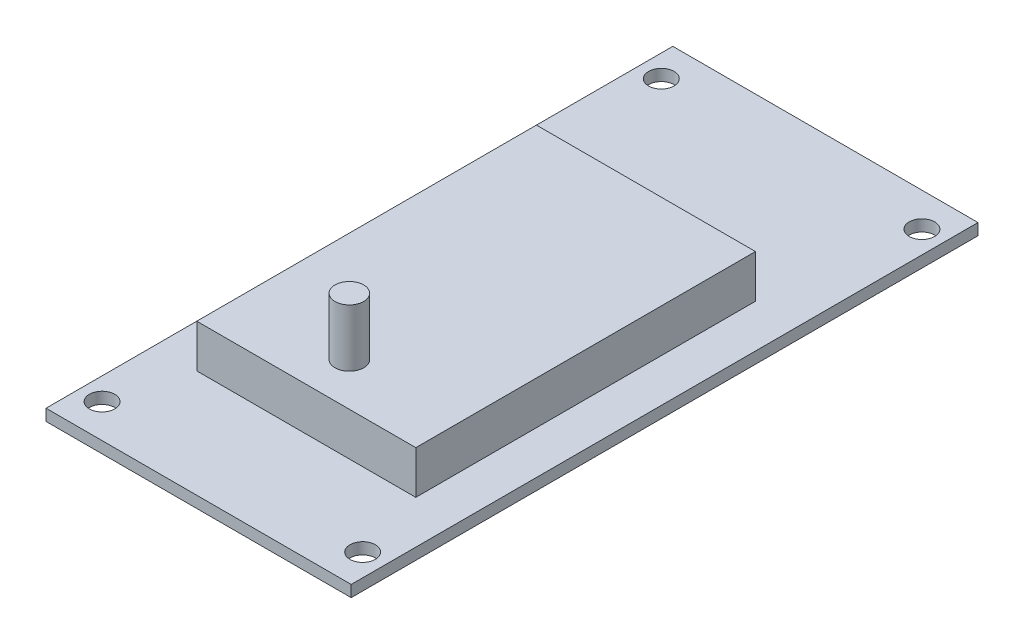
ISO-10303-21;
HEADER;
FILE_DESCRIPTION(('STEP AP214'),'2;1');
FILE_NAME('part.step','',(''),(''),'','','');
FILE_SCHEMA(('AUTOMOTIVE_DESIGN { 1 0 10303 214 1 1 1 1 }'));
ENDSEC;
DATA;
#1=APPLICATION_CONTEXT('core data for automotive mechanical design processes');
#2=APPLICATION_PROTOCOL_DEFINITION('international standard','automotive_design',2000,#1);
#3=PRODUCT_CONTEXT('',#1,'mechanical');
#4=PRODUCT('Part','Part','',(#3));
#5=PRODUCT_RELATED_PRODUCT_CATEGORY('part','',(#4));
#6=PRODUCT_DEFINITION_FORMATION('','',#4);
#7=PRODUCT_DEFINITION_CONTEXT('part definition',#1,'design');
#8=PRODUCT_DEFINITION('design','',#6,#7);
#9=PRODUCT_DEFINITION_SHAPE('','',#8);
#10=(LENGTH_UNIT() NAMED_UNIT(*) SI_UNIT(.MILLI.,.METRE.));
#11=(NAMED_UNIT(*) PLANE_ANGLE_UNIT() SI_UNIT($,.RADIAN.));
#12=(NAMED_UNIT(*) SI_UNIT($,.STERADIAN.) SOLID_ANGLE_UNIT());
#13=UNCERTAINTY_MEASURE_WITH_UNIT(LENGTH_MEASURE(1.E-05),#10,'distance_accuracy_value','');
#14=(GEOMETRIC_REPRESENTATION_CONTEXT(3) GLOBAL_UNCERTAINTY_ASSIGNED_CONTEXT((#13)) GLOBAL_UNIT_ASSIGNED_CONTEXT((#10,
#11,#12)) REPRESENTATION_CONTEXT('',''));
#15=CARTESIAN_POINT('',(0.,0.,0.));
#16=DIRECTION('',(0.,0.,1.));
#17=DIRECTION('',(1.,0.,0.));
#18=AXIS2_PLACEMENT_3D('',#15,#16,#17);
#19=CARTESIAN_POINT('',(0.,1.6,0.));
#20=DIRECTION('',(0.,-1.,0.));
#21=DIRECTION('',(0.,0.,-1.));
#22=AXIS2_PLACEMENT_3D('',#19,#20,#21);
#23=PLANE('',#22);
#24=CARTESIAN_POINT('',(39.405,1.6,-4.70499999999999));
#25=DIRECTION('',(0.,1.,0.));
#26=DIRECTION('',(0.,0.,1.));
#27=AXIS2_PLACEMENT_3D('',#24,#25,#26);
#28=CIRCLE('',#27,1.77);
#29=CARTESIAN_POINT('',(39.405,1.6,-2.93499999999999));
#30=VERTEX_POINT('',#29);
#31=EDGE_CURVE('E133',#30,#30,#28,.T.);
#32=ORIENTED_EDGE('',*,*,#31,.F.);
#33=EDGE_LOOP('',(#32));
#34=FACE_BOUND('',#33,.T.);
#35=CARTESIAN_POINT('',(3.105,1.6,-4.70499999999999));
#36=DIRECTION('',(0.,1.,0.));
#37=DIRECTION('',(0.,0.,1.));
#38=AXIS2_PLACEMENT_3D('',#35,#36,#37);
#39=CIRCLE('',#38,1.77);
#40=CARTESIAN_POINT('',(3.105,1.6,-2.93499999999999));
#41=VERTEX_POINT('',#40);
#42=EDGE_CURVE('E143',#41,#41,#39,.T.);
#43=ORIENTED_EDGE('',*,*,#42,.F.);
#44=EDGE_LOOP('',(#43));
#45=FACE_BOUND('',#44,.T.);
#46=CARTESIAN_POINT('',(39.405,1.6,-82.605));
#47=DIRECTION('',(0.,1.,0.));
#48=DIRECTION('',(0.,0.,1.));
#49=AXIS2_PLACEMENT_3D('',#46,#47,#48);
#50=CIRCLE('',#49,1.77000000000001);
#51=CARTESIAN_POINT('',(39.405,1.6,-80.835));
#52=VERTEX_POINT('',#51);
#53=EDGE_CURVE('E151',#52,#52,#50,.T.);
#54=ORIENTED_EDGE('',*,*,#53,.F.);
#55=EDGE_LOOP('',(#54));
#56=FACE_BOUND('',#55,.T.);
#57=CARTESIAN_POINT('',(3.105,1.6,-82.605));
#58=DIRECTION('',(0.,1.,0.));
#59=DIRECTION('',(0.,0.,1.));
#60=AXIS2_PLACEMENT_3D('',#57,#58,#59);
#61=CIRCLE('',#60,1.77000000000001);
#62=CARTESIAN_POINT('',(3.105,1.6,-80.835));
#63=VERTEX_POINT('',#62);
#64=EDGE_CURVE('E159',#63,#63,#61,.T.);
#65=ORIENTED_EDGE('',*,*,#64,.F.);
#66=EDGE_LOOP('',(#65));
#67=FACE_BOUND('',#66,.T.);
#68=DIRECTION('',(0.,0.,1.));
#69=VECTOR('',#68,1.);
#70=CARTESIAN_POINT('',(0.,1.6,0.));
#71=LINE('',#70,#69);
#72=CARTESIAN_POINT('',(0.,1.6,-87.31));
#73=VERTEX_POINT('',#72);
#74=CARTESIAN_POINT('',(0.,1.6,0.));
#75=VERTEX_POINT('',#74);
#76=EDGE_CURVE('E167',#73,#75,#71,.T.);
#77=ORIENTED_EDGE('',*,*,#76,.T.);
#78=DIRECTION('',(1.,0.,0.));
#79=VECTOR('',#78,1.);
#80=CARTESIAN_POINT('',(0.,1.6,0.));
#81=LINE('',#80,#79);
#82=CARTESIAN_POINT('',(42.51,1.6,0.));
#83=VERTEX_POINT('',#82);
#84=EDGE_CURVE('E171',#75,#83,#81,.T.);
#85=ORIENTED_EDGE('',*,*,#84,.T.);
#86=DIRECTION('',(0.,0.,-1.));
#87=VECTOR('',#86,1.);
#88=CARTESIAN_POINT('',(42.51,1.6,0.));
#89=LINE('',#88,#87);
#90=CARTESIAN_POINT('',(42.51,1.6,-87.31));
#91=VERTEX_POINT('',#90);
#92=EDGE_CURVE('E175',#83,#91,#89,.T.);
#93=ORIENTED_EDGE('',*,*,#92,.T.);
#94=DIRECTION('',(-1.,0.,0.));
#95=VECTOR('',#94,1.);
#96=CARTESIAN_POINT('',(0.,1.6,-87.31));
#97=LINE('',#96,#95);
#98=EDGE_CURVE('E178',#91,#73,#97,.T.);
#99=ORIENTED_EDGE('',*,*,#98,.T.);
#100=EDGE_LOOP('',(#77,#85,#93,#99));
#101=FACE_BOUND('',#100,.T.);
#102=DIRECTION('',(0.,0.,1.));
#103=VECTOR('',#102,1.);
#104=CARTESIAN_POINT('',(6.,1.6,-62.31));
#105=LINE('',#104,#103);
#106=CARTESIAN_POINT('',(6.,1.6,-62.31));
#107=VERTEX_POINT('',#106);
#108=CARTESIAN_POINT('',(6.00000000000001,1.6,-15.));
#109=VERTEX_POINT('',#108);
#110=EDGE_CURVE('E55',#107,#109,#105,.T.);
#111=ORIENTED_EDGE('',*,*,#110,.F.);
#112=DIRECTION('',(-1.,0.,0.));
#113=VECTOR('',#112,1.);
#114=CARTESIAN_POINT('',(6.,1.6,-62.31));
#115=LINE('',#114,#113);
#116=CARTESIAN_POINT('',(36.51,1.6,-62.31));
#117=VERTEX_POINT('',#116);
#118=EDGE_CURVE('E59',#117,#107,#115,.T.);
#119=ORIENTED_EDGE('',*,*,#118,.F.);
#120=DIRECTION('',(0.,0.,-1.));
#121=VECTOR('',#120,1.);
#122=CARTESIAN_POINT('',(36.51,1.6,-62.31));
#123=LINE('',#122,#121);
#124=CARTESIAN_POINT('',(36.51,1.6,-15.));
#125=VERTEX_POINT('',#124);
#126=EDGE_CURVE('E313',#125,#117,#123,.T.);
#127=ORIENTED_EDGE('',*,*,#126,.F.);
#128=DIRECTION('',(1.,0.,0.));
#129=VECTOR('',#128,1.);
#130=CARTESIAN_POINT('',(6.00000000000001,1.6,-15.));
#131=LINE('',#130,#129);
#132=EDGE_CURVE('E301',#109,#125,#131,.T.);
#133=ORIENTED_EDGE('',*,*,#132,.F.);
#134=EDGE_LOOP('',(#111,#119,#127,#133));
#135=FACE_BOUND('',#134,.T.);
#136=ADVANCED_FACE('F39',(#34,#45,#56,#67,#101,#135),#23,.F.);
#137=CARTESIAN_POINT('',(0.,0.,0.));
#138=DIRECTION('',(0.,-1.,0.));
#139=DIRECTION('',(0.,0.,-1.));
#140=AXIS2_PLACEMENT_3D('',#137,#138,#139);
#141=PLANE('',#140);
#142=CARTESIAN_POINT('',(3.105,0.,-4.70499999999999));
#143=DIRECTION('',(0.,1.,0.));
#144=DIRECTION('',(0.,0.,1.));
#145=AXIS2_PLACEMENT_3D('',#142,#143,#144);
#146=CIRCLE('',#145,1.77);
#147=CARTESIAN_POINT('',(3.105,0.,-2.93499999999999));
#148=VERTEX_POINT('',#147);
#149=EDGE_CURVE('E141',#148,#148,#146,.T.);
#150=ORIENTED_EDGE('',*,*,#149,.T.);
#151=EDGE_LOOP('',(#150));
#152=FACE_BOUND('',#151,.T.);
#153=CARTESIAN_POINT('',(3.105,0.,-82.605));
#154=DIRECTION('',(0.,1.,0.));
#155=DIRECTION('',(0.,0.,1.));
#156=AXIS2_PLACEMENT_3D('',#153,#154,#155);
#157=CIRCLE('',#156,1.77000000000001);
#158=CARTESIAN_POINT('',(3.105,0.,-80.835));
#159=VERTEX_POINT('',#158);
#160=EDGE_CURVE('E155',#159,#159,#157,.T.);
#161=ORIENTED_EDGE('',*,*,#160,.T.);
#162=EDGE_LOOP('',(#161));
#163=FACE_BOUND('',#162,.T.);
#164=DIRECTION('',(0.,0.,1.));
#165=VECTOR('',#164,1.);
#166=CARTESIAN_POINT('',(0.,0.,0.));
#167=LINE('',#166,#165);
#168=CARTESIAN_POINT('',(0.,0.,-87.31));
#169=VERTEX_POINT('',#168);
#170=CARTESIAN_POINT('',(0.,0.,0.));
#171=VERTEX_POINT('',#170);
#172=EDGE_CURVE('E163',#169,#171,#167,.T.);
#173=ORIENTED_EDGE('',*,*,#172,.F.);
#174=DIRECTION('',(-1.,0.,0.));
#175=VECTOR('',#174,1.);
#176=CARTESIAN_POINT('',(0.,0.,-87.31));
#177=LINE('',#176,#175);
#178=CARTESIAN_POINT('',(42.51,0.,-87.31));
#179=VERTEX_POINT('',#178);
#180=EDGE_CURVE('E172',#179,#169,#177,.T.);
#181=ORIENTED_EDGE('',*,*,#180,.F.);
#182=DIRECTION('',(0.,0.,-1.));
#183=VECTOR('',#182,1.);
#184=CARTESIAN_POINT('',(42.51,0.,0.));
#185=LINE('',#184,#183);
#186=CARTESIAN_POINT('',(42.51,0.,0.));
#187=VERTEX_POINT('',#186);
#188=EDGE_CURVE('E188',#187,#179,#185,.T.);
#189=ORIENTED_EDGE('',*,*,#188,.F.);
#190=DIRECTION('',(1.,0.,0.));
#191=VECTOR('',#190,1.);
#192=CARTESIAN_POINT('',(0.,0.,0.));
#193=LINE('',#192,#191);
#194=EDGE_CURVE('E185',#171,#187,#193,.T.);
#195=ORIENTED_EDGE('',*,*,#194,.F.);
#196=EDGE_LOOP('',(#173,#181,#189,#195));
#197=FACE_BOUND('',#196,.T.);
#198=CARTESIAN_POINT('',(39.405,0.,-82.605));
#199=DIRECTION('',(0.,1.,0.));
#200=DIRECTION('',(0.,0.,1.));
#201=AXIS2_PLACEMENT_3D('',#198,#199,#200);
#202=CIRCLE('',#201,1.77000000000001);
#203=CARTESIAN_POINT('',(39.405,0.,-80.835));
#204=VERTEX_POINT('',#203);
#205=EDGE_CURVE('E147',#204,#204,#202,.T.);
#206=ORIENTED_EDGE('',*,*,#205,.T.);
#207=EDGE_LOOP('',(#206));
#208=FACE_BOUND('',#207,.T.);
#209=CARTESIAN_POINT('',(39.405,0.,-4.70499999999999));
#210=DIRECTION('',(0.,1.,0.));
#211=DIRECTION('',(0.,0.,1.));
#212=AXIS2_PLACEMENT_3D('',#209,#210,#211);
#213=CIRCLE('',#212,1.77);
#214=CARTESIAN_POINT('',(39.405,0.,-2.93499999999999));
#215=VERTEX_POINT('',#214);
#216=EDGE_CURVE('E128',#215,#215,#213,.T.);
#217=ORIENTED_EDGE('',*,*,#216,.T.);
#218=EDGE_LOOP('',(#217));
#219=FACE_BOUND('',#218,.T.);
#220=ADVANCED_FACE('F211',(#152,#163,#197,#208,#219),#141,.T.);
#221=CARTESIAN_POINT('',(0.,1.6,0.));
#222=DIRECTION('',(1.,0.,0.));
#223=DIRECTION('',(0.,0.,-1.));
#224=AXIS2_PLACEMENT_3D('',#221,#222,#223);
#225=PLANE('',#224);
#226=ORIENTED_EDGE('',*,*,#172,.T.);
#227=DIRECTION('',(0.,-1.,0.));
#228=VECTOR('',#227,1.);
#229=CARTESIAN_POINT('',(0.,1.6,0.));
#230=LINE('',#229,#228);
#231=EDGE_CURVE('E11',#75,#171,#230,.T.);
#232=ORIENTED_EDGE('',*,*,#231,.F.);
#233=ORIENTED_EDGE('',*,*,#76,.F.);
#234=DIRECTION('',(0.,-1.,0.));
#235=VECTOR('',#234,1.);
#236=CARTESIAN_POINT('',(0.,1.6,-87.31));
#237=LINE('',#236,#235);
#238=EDGE_CURVE('E181',#73,#169,#237,.T.);
#239=ORIENTED_EDGE('',*,*,#238,.T.);
#240=EDGE_LOOP('',(#226,#232,#233,#239));
#241=FACE_BOUND('',#240,.T.);
#242=ADVANCED_FACE('F41',(#241),#225,.F.);
#243=CARTESIAN_POINT('',(0.,1.6,0.));
#244=DIRECTION('',(0.,0.,-1.));
#245=DIRECTION('',(-1.,0.,0.));
#246=AXIS2_PLACEMENT_3D('',#243,#244,#245);
#247=PLANE('',#246);
#248=ORIENTED_EDGE('',*,*,#194,.T.);
#249=DIRECTION('',(0.,-1.,0.));
#250=VECTOR('',#249,1.);
#251=CARTESIAN_POINT('',(42.51,1.6,0.));
#252=LINE('',#251,#250);
#253=EDGE_CURVE('E48',#83,#187,#252,.T.);
#254=ORIENTED_EDGE('',*,*,#253,.F.);
#255=ORIENTED_EDGE('',*,*,#84,.F.);
#256=ORIENTED_EDGE('',*,*,#231,.T.);
#257=EDGE_LOOP('',(#248,#254,#255,#256));
#258=FACE_BOUND('',#257,.T.);
#259=ADVANCED_FACE('F221',(#258),#247,.F.);
#260=CARTESIAN_POINT('',(42.51,1.6,0.));
#261=DIRECTION('',(-1.,0.,0.));
#262=DIRECTION('',(0.,0.,1.));
#263=AXIS2_PLACEMENT_3D('',#260,#261,#262);
#264=PLANE('',#263);
#265=ORIENTED_EDGE('',*,*,#188,.T.);
#266=DIRECTION('',(0.,-1.,0.));
#267=VECTOR('',#266,1.);
#268=CARTESIAN_POINT('',(42.51,1.6,-87.31));
#269=LINE('',#268,#267);
#270=EDGE_CURVE('E196',#91,#179,#269,.T.);
#271=ORIENTED_EDGE('',*,*,#270,.F.);
#272=ORIENTED_EDGE('',*,*,#92,.F.);
#273=ORIENTED_EDGE('',*,*,#253,.T.);
#274=EDGE_LOOP('',(#265,#271,#272,#273));
#275=FACE_BOUND('',#274,.T.);
#276=ADVANCED_FACE('F205',(#275),#264,.F.);
#277=CARTESIAN_POINT('',(0.,1.6,-87.31));
#278=DIRECTION('',(0.,0.,1.));
#279=DIRECTION('',(1.,0.,0.));
#280=AXIS2_PLACEMENT_3D('',#277,#278,#279);
#281=PLANE('',#280);
#282=ORIENTED_EDGE('',*,*,#180,.T.);
#283=ORIENTED_EDGE('',*,*,#238,.F.);
#284=ORIENTED_EDGE('',*,*,#98,.F.);
#285=ORIENTED_EDGE('',*,*,#270,.T.);
#286=EDGE_LOOP('',(#282,#283,#284,#285));
#287=FACE_BOUND('',#286,.T.);
#288=ADVANCED_FACE('F215',(#287),#281,.F.);
#289=CARTESIAN_POINT('',(3.105,1.6,-82.605));
#290=DIRECTION('',(0.,-1.,0.));
#291=DIRECTION('',(0.,0.,-1.));
#292=AXIS2_PLACEMENT_3D('',#289,#290,#291);
#293=CYLINDRICAL_SURFACE('',#292,1.77000000000001);
#294=ORIENTED_EDGE('',*,*,#64,.T.);
#295=EDGE_LOOP('',(#294));
#296=FACE_BOUND('',#295,.T.);
#297=ORIENTED_EDGE('',*,*,#160,.F.);
#298=EDGE_LOOP('',(#297));
#299=FACE_BOUND('',#298,.T.);
#300=ADVANCED_FACE('F239',(#296,#299),#293,.F.);
#301=CARTESIAN_POINT('',(39.405,1.6,-82.605));
#302=DIRECTION('',(0.,-1.,0.));
#303=DIRECTION('',(0.,0.,-1.));
#304=AXIS2_PLACEMENT_3D('',#301,#302,#303);
#305=CYLINDRICAL_SURFACE('',#304,1.77000000000001);
#306=ORIENTED_EDGE('',*,*,#53,.T.);
#307=EDGE_LOOP('',(#306));
#308=FACE_BOUND('',#307,.T.);
#309=ORIENTED_EDGE('',*,*,#205,.F.);
#310=EDGE_LOOP('',(#309));
#311=FACE_BOUND('',#310,.T.);
#312=ADVANCED_FACE('F246',(#308,#311),#305,.F.);
#313=CARTESIAN_POINT('',(3.105,1.6,-4.70499999999999));
#314=DIRECTION('',(0.,-1.,0.));
#315=DIRECTION('',(0.,0.,-1.));
#316=AXIS2_PLACEMENT_3D('',#313,#314,#315);
#317=CYLINDRICAL_SURFACE('',#316,1.77);
#318=ORIENTED_EDGE('',*,*,#42,.T.);
#319=EDGE_LOOP('',(#318));
#320=FACE_BOUND('',#319,.T.);
#321=ORIENTED_EDGE('',*,*,#149,.F.);
#322=EDGE_LOOP('',(#321));
#323=FACE_BOUND('',#322,.T.);
#324=ADVANCED_FACE('F251',(#320,#323),#317,.F.);
#325=CARTESIAN_POINT('',(39.405,1.6,-4.70499999999999));
#326=DIRECTION('',(0.,-1.,0.));
#327=DIRECTION('',(0.,0.,-1.));
#328=AXIS2_PLACEMENT_3D('',#325,#326,#327);
#329=CYLINDRICAL_SURFACE('',#328,1.77);
#330=ORIENTED_EDGE('',*,*,#31,.T.);
#331=EDGE_LOOP('',(#330));
#332=FACE_BOUND('',#331,.T.);
#333=ORIENTED_EDGE('',*,*,#216,.F.);
#334=EDGE_LOOP('',(#333));
#335=FACE_BOUND('',#334,.T.);
#336=ADVANCED_FACE('F261',(#332,#335),#329,.F.);
#337=CARTESIAN_POINT('',(6.,7.6,-62.31));
#338=DIRECTION('',(1.,0.,0.));
#339=DIRECTION('',(0.,0.,-1.));
#340=AXIS2_PLACEMENT_3D('',#337,#338,#339);
#341=PLANE('',#340);
#342=ORIENTED_EDGE('',*,*,#110,.T.);
#343=DIRECTION('',(0.,-1.,0.));
#344=VECTOR('',#343,1.);
#345=CARTESIAN_POINT('',(6.00000000000001,7.6,-15.));
#346=LINE('',#345,#344);
#347=CARTESIAN_POINT('',(6.00000000000001,7.6,-15.));
#348=VERTEX_POINT('',#347);
#349=EDGE_CURVE('E108',#348,#109,#346,.T.);
#350=ORIENTED_EDGE('',*,*,#349,.F.);
#351=DIRECTION('',(0.,0.,1.));
#352=VECTOR('',#351,1.);
#353=CARTESIAN_POINT('',(6.,7.6,-62.31));
#354=LINE('',#353,#352);
#355=CARTESIAN_POINT('',(6.,7.6,-62.31));
#356=VERTEX_POINT('',#355);
#357=EDGE_CURVE('E115',#356,#348,#354,.T.);
#358=ORIENTED_EDGE('',*,*,#357,.F.);
#359=DIRECTION('',(0.,-1.,0.));
#360=VECTOR('',#359,1.);
#361=CARTESIAN_POINT('',(6.,7.6,-62.31));
#362=LINE('',#361,#360);
#363=EDGE_CURVE('E309',#356,#107,#362,.T.);
#364=ORIENTED_EDGE('',*,*,#363,.T.);
#365=EDGE_LOOP('',(#342,#350,#358,#364));
#366=FACE_BOUND('',#365,.T.);
#367=ADVANCED_FACE('F126',(#366),#341,.F.);
#368=CARTESIAN_POINT('',(6.00000000000001,7.6,-15.));
#369=DIRECTION('',(0.,0.,-1.));
#370=DIRECTION('',(-1.,0.,0.));
#371=AXIS2_PLACEMENT_3D('',#368,#369,#370);
#372=PLANE('',#371);
#373=ORIENTED_EDGE('',*,*,#132,.T.);
#374=DIRECTION('',(0.,-1.,0.));
#375=VECTOR('',#374,1.);
#376=CARTESIAN_POINT('',(36.51,7.6,-15.));
#377=LINE('',#376,#375);
#378=CARTESIAN_POINT('',(36.51,7.6,-15.));
#379=VERTEX_POINT('',#378);
#380=EDGE_CURVE('E110',#379,#125,#377,.T.);
#381=ORIENTED_EDGE('',*,*,#380,.F.);
#382=DIRECTION('',(1.,0.,0.));
#383=VECTOR('',#382,1.);
#384=CARTESIAN_POINT('',(6.00000000000001,7.6,-15.));
#385=LINE('',#384,#383);
#386=EDGE_CURVE('E103',#348,#379,#385,.T.);
#387=ORIENTED_EDGE('',*,*,#386,.F.);
#388=ORIENTED_EDGE('',*,*,#349,.T.);
#389=EDGE_LOOP('',(#373,#381,#387,#388));
#390=FACE_BOUND('',#389,.T.);
#391=ADVANCED_FACE('F106',(#390),#372,.F.);
#392=CARTESIAN_POINT('',(36.51,7.6,-62.31));
#393=DIRECTION('',(-1.,0.,0.));
#394=DIRECTION('',(0.,0.,1.));
#395=AXIS2_PLACEMENT_3D('',#392,#393,#394);
#396=PLANE('',#395);
#397=ORIENTED_EDGE('',*,*,#126,.T.);
#398=DIRECTION('',(0.,-1.,0.));
#399=VECTOR('',#398,1.);
#400=CARTESIAN_POINT('',(36.51,7.6,-62.31));
#401=LINE('',#400,#399);
#402=CARTESIAN_POINT('',(36.51,7.6,-62.31));
#403=VERTEX_POINT('',#402);
#404=EDGE_CURVE('E135',#403,#117,#401,.T.);
#405=ORIENTED_EDGE('',*,*,#404,.F.);
#406=DIRECTION('',(0.,0.,-1.));
#407=VECTOR('',#406,1.);
#408=CARTESIAN_POINT('',(36.51,7.6,-62.31));
#409=LINE('',#408,#407);
#410=EDGE_CURVE('E114',#379,#403,#409,.T.);
#411=ORIENTED_EDGE('',*,*,#410,.F.);
#412=ORIENTED_EDGE('',*,*,#380,.T.);
#413=EDGE_LOOP('',(#397,#405,#411,#412));
#414=FACE_BOUND('',#413,.T.);
#415=ADVANCED_FACE('F273',(#414),#396,.F.);
#416=CARTESIAN_POINT('',(6.,7.6,-62.31));
#417=DIRECTION('',(0.,0.,1.));
#418=DIRECTION('',(1.,0.,0.));
#419=AXIS2_PLACEMENT_3D('',#416,#417,#418);
#420=PLANE('',#419);
#421=ORIENTED_EDGE('',*,*,#118,.T.);
#422=ORIENTED_EDGE('',*,*,#363,.F.);
#423=DIRECTION('',(-1.,0.,0.));
#424=VECTOR('',#423,1.);
#425=CARTESIAN_POINT('',(6.,7.6,-62.31));
#426=LINE('',#425,#424);
#427=EDGE_CURVE('E120',#403,#356,#426,.T.);
#428=ORIENTED_EDGE('',*,*,#427,.F.);
#429=ORIENTED_EDGE('',*,*,#404,.T.);
#430=EDGE_LOOP('',(#421,#422,#428,#429));
#431=FACE_BOUND('',#430,.T.);
#432=ADVANCED_FACE('F276',(#431),#420,.F.);
#433=CARTESIAN_POINT('',(0.,7.6,0.));
#434=DIRECTION('',(0.,1.,0.));
#435=DIRECTION('',(0.,0.,1.));
#436=AXIS2_PLACEMENT_3D('',#433,#434,#435);
#437=PLANE('',#436);
#438=CARTESIAN_POINT('',(21.255,7.6,-21.));
#439=DIRECTION('',(0.,1.,0.));
#440=DIRECTION('',(0.,0.,1.));
#441=AXIS2_PLACEMENT_3D('',#438,#439,#440);
#442=CIRCLE('',#441,2.);
#443=CARTESIAN_POINT('',(21.255,7.6,-19.));
#444=VERTEX_POINT('',#443);
#445=EDGE_CURVE('E297',#444,#444,#442,.T.);
#446=ORIENTED_EDGE('',*,*,#445,.F.);
#447=EDGE_LOOP('',(#446));
#448=FACE_BOUND('',#447,.T.);
#449=ORIENTED_EDGE('',*,*,#357,.T.);
#450=ORIENTED_EDGE('',*,*,#386,.T.);
#451=ORIENTED_EDGE('',*,*,#410,.T.);
#452=ORIENTED_EDGE('',*,*,#427,.T.);
#453=EDGE_LOOP('',(#449,#450,#451,#452));
#454=FACE_BOUND('',#453,.T.);
#455=ADVANCED_FACE('F118',(#448,#454),#437,.T.);
#456=CARTESIAN_POINT('',(21.255,15.6,-21.));
#457=DIRECTION('',(0.,-1.,0.));
#458=DIRECTION('',(0.,0.,-1.));
#459=AXIS2_PLACEMENT_3D('',#456,#457,#458);
#460=CYLINDRICAL_SURFACE('',#459,2.);
#461=CARTESIAN_POINT('',(21.255,15.6,-21.));
#462=DIRECTION('',(0.,1.,0.));
#463=DIRECTION('',(0.,0.,1.));
#464=AXIS2_PLACEMENT_3D('',#461,#462,#463);
#465=CIRCLE('',#464,2.);
#466=CARTESIAN_POINT('',(21.255,15.6,-19.));
#467=VERTEX_POINT('',#466);
#468=EDGE_CURVE('E295',#467,#467,#465,.T.);
#469=ORIENTED_EDGE('',*,*,#468,.F.);
#470=EDGE_LOOP('',(#469));
#471=FACE_BOUND('',#470,.T.);
#472=ORIENTED_EDGE('',*,*,#445,.T.);
#473=EDGE_LOOP('',(#472));
#474=FACE_BOUND('',#473,.T.);
#475=ADVANCED_FACE('F283',(#471,#474),#460,.T.);
#476=CARTESIAN_POINT('',(21.255,15.6,-21.));
#477=DIRECTION('',(0.,1.,0.));
#478=DIRECTION('',(0.,0.,1.));
#479=AXIS2_PLACEMENT_3D('',#476,#477,#478);
#480=PLANE('',#479);
#481=ORIENTED_EDGE('',*,*,#468,.T.);
#482=EDGE_LOOP('',(#481));
#483=FACE_BOUND('',#482,.T.);
#484=ADVANCED_FACE('F287',(#483),#480,.T.);
#485=CLOSED_SHELL('',(#136,#220,#242,#259,#276,#288,#300,#312,#324,#336,#367,#391,#415,#432,
#455,#475,#484));
#486=MANIFOLD_SOLID_BREP('B2',#485);
#487=ADVANCED_BREP_SHAPE_REPRESENTATION('',(#18,#486),#14);
#488=SHAPE_DEFINITION_REPRESENTATION(#9,#487);
ENDSEC;
END-ISO-10303-21;
